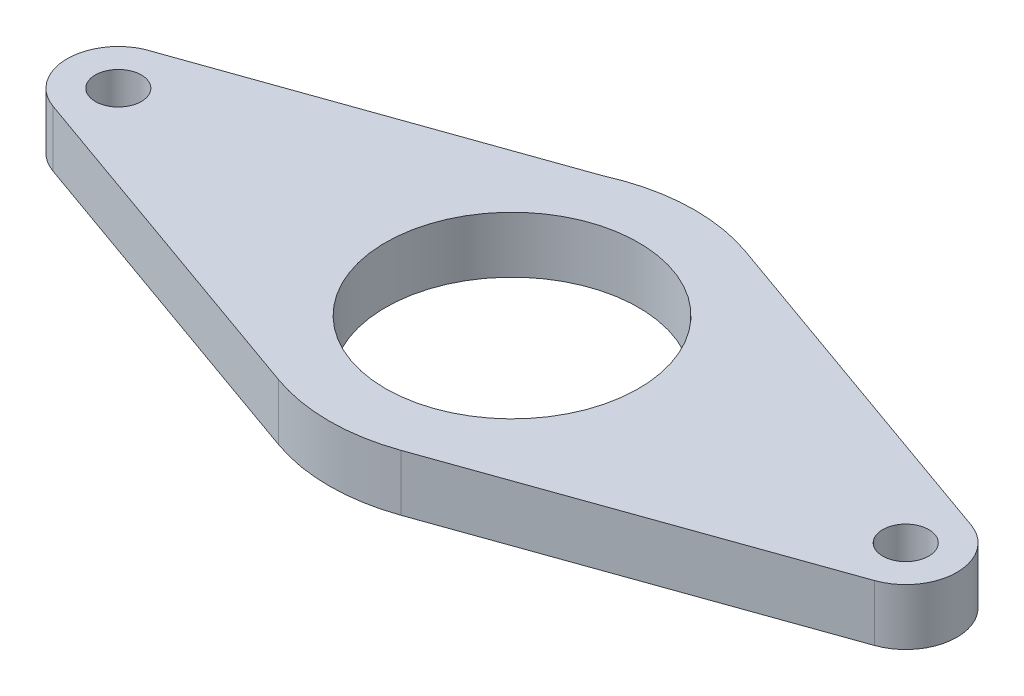
ISO-10303-21;
HEADER;
FILE_DESCRIPTION(('STEP AP214'),'2;1');
FILE_NAME('part.step','',(''),(''),'','','');
FILE_SCHEMA(('AUTOMOTIVE_DESIGN { 1 0 10303 214 1 1 1 1 }'));
ENDSEC;
DATA;
#1=APPLICATION_CONTEXT('core data for automotive mechanical design processes');
#2=APPLICATION_PROTOCOL_DEFINITION('international standard','automotive_design',2000,#1);
#3=PRODUCT_CONTEXT('',#1,'mechanical');
#4=PRODUCT('Part','Part','',(#3));
#5=PRODUCT_RELATED_PRODUCT_CATEGORY('part','',(#4));
#6=PRODUCT_DEFINITION_FORMATION('','',#4);
#7=PRODUCT_DEFINITION_CONTEXT('part definition',#1,'design');
#8=PRODUCT_DEFINITION('design','',#6,#7);
#9=PRODUCT_DEFINITION_SHAPE('','',#8);
#10=(LENGTH_UNIT() NAMED_UNIT(*) SI_UNIT(.MILLI.,.METRE.));
#11=(NAMED_UNIT(*) PLANE_ANGLE_UNIT() SI_UNIT($,.RADIAN.));
#12=(NAMED_UNIT(*) SI_UNIT($,.STERADIAN.) SOLID_ANGLE_UNIT());
#13=UNCERTAINTY_MEASURE_WITH_UNIT(LENGTH_MEASURE(1.E-05),#10,'distance_accuracy_value','');
#14=(GEOMETRIC_REPRESENTATION_CONTEXT(3) GLOBAL_UNCERTAINTY_ASSIGNED_CONTEXT((#13)) GLOBAL_UNIT_ASSIGNED_CONTEXT((#10,
#11,#12)) REPRESENTATION_CONTEXT('',''));
#15=CARTESIAN_POINT('',(0.,0.,0.));
#16=DIRECTION('',(0.,0.,1.));
#17=DIRECTION('',(1.,0.,0.));
#18=AXIS2_PLACEMENT_3D('',#15,#16,#17);
#19=CARTESIAN_POINT('',(6.90044642857143,6.35,19.4496849675365));
#20=DIRECTION('',(-0.334364454443195,0.,-0.942443850637747));
#21=DIRECTION('',(-0.942443850637747,0.,0.334364454443195));
#22=AXIS2_PLACEMENT_3D('',#19,#20,#21);
#23=PLANE('',#22);
#24=DIRECTION('',(0.942443850637747,0.,-0.334364454443195));
#25=VECTOR('',#24,1.);
#26=CARTESIAN_POINT('',(6.90044642857143,0.,19.4496849675365));
#27=LINE('',#26,#25);
#28=CARTESIAN_POINT('',(6.90044642857143,0.,19.4496849675365));
#29=VERTEX_POINT('',#28);
#30=CARTESIAN_POINT('',(46.3809547244094,0.,5.442613237433));
#31=VERTEX_POINT('',#30);
#32=EDGE_CURVE('E155',#29,#31,#27,.T.);
#33=ORIENTED_EDGE('',*,*,#32,.T.);
#34=DIRECTION('',(0.,-1.,0.));
#35=VECTOR('',#34,1.);
#36=CARTESIAN_POINT('',(46.3809547244094,6.35,5.442613237433));
#37=LINE('',#36,#35);
#38=CARTESIAN_POINT('',(46.3809547244094,6.35,5.442613237433));
#39=VERTEX_POINT('',#38);
#40=EDGE_CURVE('E11',#39,#31,#37,.T.);
#41=ORIENTED_EDGE('',*,*,#40,.F.);
#42=DIRECTION('',(0.942443850637747,0.,-0.334364454443195));
#43=VECTOR('',#42,1.);
#44=CARTESIAN_POINT('',(6.90044642857143,6.35,19.4496849675365));
#45=LINE('',#44,#43);
#46=CARTESIAN_POINT('',(6.90044642857143,6.35,19.4496849675365));
#47=VERTEX_POINT('',#46);
#48=EDGE_CURVE('E191',#47,#39,#45,.T.);
#49=ORIENTED_EDGE('',*,*,#48,.F.);
#50=DIRECTION('',(0.,-1.,0.));
#51=VECTOR('',#50,1.);
#52=CARTESIAN_POINT('',(6.90044642857143,6.35,19.4496849675365));
#53=LINE('',#52,#51);
#54=EDGE_CURVE('E154',#47,#29,#53,.T.);
#55=ORIENTED_EDGE('',*,*,#54,.T.);
#56=EDGE_LOOP('',(#33,#41,#49,#55));
#57=FACE_BOUND('',#56,.T.);
#58=ADVANCED_FACE('F41',(#57),#23,.F.);
#59=CARTESIAN_POINT('',(44.45,6.35,0.));
#60=DIRECTION('',(0.,-1.,0.));
#61=DIRECTION('',(0.,0.,-1.));
#62=AXIS2_PLACEMENT_3D('',#59,#60,#61);
#63=CYLINDRICAL_SURFACE('',#62,5.775);
#64=CARTESIAN_POINT('',(44.45,0.,0.));
#65=DIRECTION('',(0.,1.,0.));
#66=DIRECTION('',(0.,0.,1.));
#67=AXIS2_PLACEMENT_3D('',#64,#65,#66);
#68=CIRCLE('',#67,5.775);
#69=CARTESIAN_POINT('',(46.3809547244094,0.,-5.44261323743299));
#70=VERTEX_POINT('',#69);
#71=EDGE_CURVE('E159',#31,#70,#68,.T.);
#72=ORIENTED_EDGE('',*,*,#71,.T.);
#73=DIRECTION('',(0.,-1.,0.));
#74=VECTOR('',#73,1.);
#75=CARTESIAN_POINT('',(46.3809547244094,6.35,-5.44261323743299));
#76=LINE('',#75,#74);
#77=CARTESIAN_POINT('',(46.3809547244094,6.35,-5.44261323743299));
#78=VERTEX_POINT('',#77);
#79=EDGE_CURVE('E50',#78,#70,#76,.T.);
#80=ORIENTED_EDGE('',*,*,#79,.F.);
#81=CARTESIAN_POINT('',(44.45,6.35,0.));
#82=DIRECTION('',(0.,1.,0.));
#83=DIRECTION('',(0.,0.,1.));
#84=AXIS2_PLACEMENT_3D('',#81,#82,#83);
#85=CIRCLE('',#84,5.775);
#86=EDGE_CURVE('E101',#39,#78,#85,.T.);
#87=ORIENTED_EDGE('',*,*,#86,.F.);
#88=ORIENTED_EDGE('',*,*,#40,.T.);
#89=EDGE_LOOP('',(#72,#80,#87,#88));
#90=FACE_BOUND('',#89,.T.);
#91=ADVANCED_FACE('F211',(#90),#63,.T.);
#92=CARTESIAN_POINT('',(6.90044642857143,6.35,-19.4496849675365));
#93=DIRECTION('',(0.334364454443195,0.,-0.942443850637747));
#94=DIRECTION('',(-0.942443850637747,0.,-0.334364454443195));
#95=AXIS2_PLACEMENT_3D('',#92,#93,#94);
#96=PLANE('',#95);
#97=DIRECTION('',(0.942443850637748,0.,0.334364454443195));
#98=VECTOR('',#97,1.);
#99=CARTESIAN_POINT('',(6.90044642857143,0.,-19.4496849675365));
#100=LINE('',#99,#98);
#101=CARTESIAN_POINT('',(6.90044642857143,0.,-19.4496849675365));
#102=VERTEX_POINT('',#101);
#103=EDGE_CURVE('E163',#102,#70,#100,.T.);
#104=ORIENTED_EDGE('',*,*,#103,.F.);
#105=DIRECTION('',(0.,-1.,0.));
#106=VECTOR('',#105,1.);
#107=CARTESIAN_POINT('',(6.90044642857143,6.35,-19.4496849675365));
#108=LINE('',#107,#106);
#109=CARTESIAN_POINT('',(6.90044642857143,6.35,-19.4496849675365));
#110=VERTEX_POINT('',#109);
#111=EDGE_CURVE('E202',#110,#102,#108,.T.);
#112=ORIENTED_EDGE('',*,*,#111,.F.);
#113=DIRECTION('',(0.942443850637748,0.,0.334364454443195));
#114=VECTOR('',#113,1.);
#115=CARTESIAN_POINT('',(6.90044642857143,6.35,-19.4496849675365));
#116=LINE('',#115,#114);
#117=EDGE_CURVE('E210',#110,#78,#116,.T.);
#118=ORIENTED_EDGE('',*,*,#117,.T.);
#119=ORIENTED_EDGE('',*,*,#79,.T.);
#120=EDGE_LOOP('',(#104,#112,#118,#119));
#121=FACE_BOUND('',#120,.T.);
#122=ADVANCED_FACE('F208',(#121),#96,.T.);
#123=CARTESIAN_POINT('',(0.,6.35,0.));
#124=DIRECTION('',(0.,-1.,0.));
#125=DIRECTION('',(0.,0.,-1.));
#126=AXIS2_PLACEMENT_3D('',#123,#124,#125);
#127=CYLINDRICAL_SURFACE('',#126,20.6375);
#128=CARTESIAN_POINT('',(0.,0.,0.));
#129=DIRECTION('',(0.,1.,0.));
#130=DIRECTION('',(0.,0.,1.));
#131=AXIS2_PLACEMENT_3D('',#128,#129,#130);
#132=CIRCLE('',#131,20.6375);
#133=CARTESIAN_POINT('',(-8.44261363636364,0.,-18.8315873265396));
#134=VERTEX_POINT('',#133);
#135=EDGE_CURVE('E167',#102,#134,#132,.T.);
#136=ORIENTED_EDGE('',*,*,#135,.T.);
#137=DIRECTION('',(0.,-1.,0.));
#138=VECTOR('',#137,1.);
#139=CARTESIAN_POINT('',(-8.44261363636364,6.35,-18.8315873265396));
#140=LINE('',#139,#138);
#141=CARTESIAN_POINT('',(-8.44261363636364,6.35,-18.8315873265396));
#142=VERTEX_POINT('',#141);
#143=EDGE_CURVE('E198',#142,#134,#140,.T.);
#144=ORIENTED_EDGE('',*,*,#143,.F.);
#145=CARTESIAN_POINT('',(0.,6.35,0.));
#146=DIRECTION('',(0.,1.,0.));
#147=DIRECTION('',(0.,0.,1.));
#148=AXIS2_PLACEMENT_3D('',#145,#146,#147);
#149=CIRCLE('',#148,20.6375);
#150=EDGE_CURVE('E226',#110,#142,#149,.T.);
#151=ORIENTED_EDGE('',*,*,#150,.F.);
#152=ORIENTED_EDGE('',*,*,#111,.T.);
#153=EDGE_LOOP('',(#136,#144,#151,#152));
#154=FACE_BOUND('',#153,.T.);
#155=ADVANCED_FACE('F221',(#154),#127,.T.);
#156=CARTESIAN_POINT('',(-6.85447760040929,6.35,-19.3929181585401));
#157=DIRECTION('',(0.333248872563735,0.,0.942838898717591));
#158=DIRECTION('',(0.942838898717591,0.,-0.333248872563735));
#159=AXIS2_PLACEMENT_3D('',#156,#157,#158);
#160=PLANE('',#159);
#161=DIRECTION('',(-0.942838898717591,0.,0.333248872563735));
#162=VECTOR('',#161,1.);
#163=CARTESIAN_POINT('',(-6.85447760040929,0.,-19.3929181585401));
#164=LINE('',#163,#162);
#165=CARTESIAN_POINT('',(-46.8125,0.,-5.26965072371973));
#166=VERTEX_POINT('',#165);
#167=EDGE_CURVE('E170',#134,#166,#164,.T.);
#168=ORIENTED_EDGE('',*,*,#167,.T.);
#169=DIRECTION('',(0.,-1.,0.));
#170=VECTOR('',#169,1.);
#171=CARTESIAN_POINT('',(-46.8125,6.35,-5.26965072371973));
#172=LINE('',#171,#170);
#173=CARTESIAN_POINT('',(-46.8125,6.35,-5.26965072371973));
#174=VERTEX_POINT('',#173);
#175=EDGE_CURVE('E132',#174,#166,#172,.T.);
#176=ORIENTED_EDGE('',*,*,#175,.F.);
#177=DIRECTION('',(-0.942838898717591,0.,0.333248872563735));
#178=VECTOR('',#177,1.);
#179=CARTESIAN_POINT('',(-6.85447760040929,6.35,-19.3929181585401));
#180=LINE('',#179,#178);
#181=EDGE_CURVE('E121',#142,#174,#180,.T.);
#182=ORIENTED_EDGE('',*,*,#181,.F.);
#183=ORIENTED_EDGE('',*,*,#143,.T.);
#184=EDGE_LOOP('',(#168,#176,#182,#183));
#185=FACE_BOUND('',#184,.T.);
#186=ADVANCED_FACE('F224',(#185),#160,.F.);
#187=CARTESIAN_POINT('',(-44.45,6.35,0.));
#188=DIRECTION('',(0.,-1.,0.));
#189=DIRECTION('',(0.,0.,-1.));
#190=AXIS2_PLACEMENT_3D('',#187,#188,#189);
#191=CYLINDRICAL_SURFACE('',#190,5.775);
#192=CARTESIAN_POINT('',(-44.45,0.,0.));
#193=DIRECTION('',(0.,1.,0.));
#194=DIRECTION('',(0.,0.,1.));
#195=AXIS2_PLACEMENT_3D('',#192,#193,#194);
#196=CIRCLE('',#195,5.775);
#197=CARTESIAN_POINT('',(-46.3809547244094,0.,5.442613237433));
#198=VERTEX_POINT('',#197);
#199=EDGE_CURVE('E130',#166,#198,#196,.T.);
#200=ORIENTED_EDGE('',*,*,#199,.T.);
#201=DIRECTION('',(0.,-1.,0.));
#202=VECTOR('',#201,1.);
#203=CARTESIAN_POINT('',(-46.3809547244094,6.35,5.442613237433));
#204=LINE('',#203,#202);
#205=CARTESIAN_POINT('',(-46.3809547244094,6.35,5.442613237433));
#206=VERTEX_POINT('',#205);
#207=EDGE_CURVE('E127',#206,#198,#204,.T.);
#208=ORIENTED_EDGE('',*,*,#207,.F.);
#209=CARTESIAN_POINT('',(-44.45,6.35,0.));
#210=DIRECTION('',(0.,1.,0.));
#211=DIRECTION('',(0.,0.,1.));
#212=AXIS2_PLACEMENT_3D('',#209,#210,#211);
#213=CIRCLE('',#212,5.775);
#214=EDGE_CURVE('E114',#174,#206,#213,.T.);
#215=ORIENTED_EDGE('',*,*,#214,.F.);
#216=ORIENTED_EDGE('',*,*,#175,.T.);
#217=EDGE_LOOP('',(#200,#208,#215,#216));
#218=FACE_BOUND('',#217,.T.);
#219=ADVANCED_FACE('F128',(#218),#191,.T.);
#220=CARTESIAN_POINT('',(-6.90044642857142,6.35,19.4496849675365));
#221=DIRECTION('',(0.334364454443194,0.,-0.942443850637747));
#222=DIRECTION('',(-0.942443850637747,0.,-0.334364454443194));
#223=AXIS2_PLACEMENT_3D('',#220,#221,#222);
#224=PLANE('',#223);
#225=DIRECTION('',(0.942443850637747,0.,0.334364454443194));
#226=VECTOR('',#225,1.);
#227=CARTESIAN_POINT('',(-6.90044642857142,0.,19.4496849675365));
#228=LINE('',#227,#226);
#229=CARTESIAN_POINT('',(-6.90044642857143,0.,19.4496849675365));
#230=VERTEX_POINT('',#229);
#231=EDGE_CURVE('E87',#198,#230,#228,.T.);
#232=ORIENTED_EDGE('',*,*,#231,.T.);
#233=DIRECTION('',(0.,-1.,0.));
#234=VECTOR('',#233,1.);
#235=CARTESIAN_POINT('',(-6.90044642857143,6.35,19.4496849675365));
#236=LINE('',#235,#234);
#237=CARTESIAN_POINT('',(-6.90044642857143,6.35,19.4496849675365));
#238=VERTEX_POINT('',#237);
#239=EDGE_CURVE('E133',#238,#230,#236,.T.);
#240=ORIENTED_EDGE('',*,*,#239,.F.);
#241=DIRECTION('',(0.942443850637747,0.,0.334364454443194));
#242=VECTOR('',#241,1.);
#243=CARTESIAN_POINT('',(-6.90044642857142,6.35,19.4496849675365));
#244=LINE('',#243,#242);
#245=EDGE_CURVE('E119',#206,#238,#244,.T.);
#246=ORIENTED_EDGE('',*,*,#245,.F.);
#247=ORIENTED_EDGE('',*,*,#207,.T.);
#248=EDGE_LOOP('',(#232,#240,#246,#247));
#249=FACE_BOUND('',#248,.T.);
#250=ADVANCED_FACE('F135',(#249),#224,.F.);
#251=CARTESIAN_POINT('',(-44.45,6.35,0.));
#252=DIRECTION('',(0.,-1.,0.));
#253=DIRECTION('',(0.,0.,-1.));
#254=AXIS2_PLACEMENT_3D('',#251,#252,#253);
#255=CYLINDRICAL_SURFACE('',#254,2.6);
#256=CARTESIAN_POINT('',(-44.45,6.35,0.));
#257=DIRECTION('',(0.,1.,0.));
#258=DIRECTION('',(0.,0.,1.));
#259=AXIS2_PLACEMENT_3D('',#256,#257,#258);
#260=CIRCLE('',#259,2.6);
#261=CARTESIAN_POINT('',(-44.45,6.35,2.6));
#262=VERTEX_POINT('',#261);
#263=EDGE_CURVE('E146',#262,#262,#260,.T.);
#264=ORIENTED_EDGE('',*,*,#263,.T.);
#265=EDGE_LOOP('',(#264));
#266=FACE_BOUND('',#265,.T.);
#267=CARTESIAN_POINT('',(-44.45,0.,0.));
#268=DIRECTION('',(0.,1.,0.));
#269=DIRECTION('',(0.,0.,1.));
#270=AXIS2_PLACEMENT_3D('',#267,#268,#269);
#271=CIRCLE('',#270,2.6);
#272=CARTESIAN_POINT('',(-44.45,0.,2.6));
#273=VERTEX_POINT('',#272);
#274=EDGE_CURVE('E183',#273,#273,#271,.T.);
#275=ORIENTED_EDGE('',*,*,#274,.F.);
#276=EDGE_LOOP('',(#275));
#277=FACE_BOUND('',#276,.T.);
#278=ADVANCED_FACE('F248',(#266,#277),#255,.F.);
#279=CARTESIAN_POINT('',(0.,6.35,0.));
#280=DIRECTION('',(0.,-1.,0.));
#281=DIRECTION('',(0.,0.,-1.));
#282=AXIS2_PLACEMENT_3D('',#279,#280,#281);
#283=CYLINDRICAL_SURFACE('',#282,14.2875);
#284=CARTESIAN_POINT('',(0.,6.35,0.));
#285=DIRECTION('',(0.,1.,0.));
#286=DIRECTION('',(0.,0.,1.));
#287=AXIS2_PLACEMENT_3D('',#284,#285,#286);
#288=CIRCLE('',#287,14.2875);
#289=CARTESIAN_POINT('',(0.,6.35,14.2875));
#290=VERTEX_POINT('',#289);
#291=EDGE_CURVE('E139',#290,#290,#288,.T.);
#292=ORIENTED_EDGE('',*,*,#291,.T.);
#293=EDGE_LOOP('',(#292));
#294=FACE_BOUND('',#293,.T.);
#295=CARTESIAN_POINT('',(0.,0.,0.));
#296=DIRECTION('',(0.,1.,0.));
#297=DIRECTION('',(0.,0.,1.));
#298=AXIS2_PLACEMENT_3D('',#295,#296,#297);
#299=CIRCLE('',#298,14.2875);
#300=CARTESIAN_POINT('',(0.,0.,14.2875));
#301=VERTEX_POINT('',#300);
#302=EDGE_CURVE('E179',#301,#301,#299,.T.);
#303=ORIENTED_EDGE('',*,*,#302,.F.);
#304=EDGE_LOOP('',(#303));
#305=FACE_BOUND('',#304,.T.);
#306=ADVANCED_FACE('F240',(#294,#305),#283,.F.);
#307=CARTESIAN_POINT('',(0.,6.35,0.));
#308=DIRECTION('',(0.,-1.,0.));
#309=DIRECTION('',(0.,0.,-1.));
#310=AXIS2_PLACEMENT_3D('',#307,#308,#309);
#311=CYLINDRICAL_SURFACE('',#310,20.6375);
#312=CARTESIAN_POINT('',(0.,0.,0.));
#313=DIRECTION('',(0.,1.,0.));
#314=DIRECTION('',(0.,0.,1.));
#315=AXIS2_PLACEMENT_3D('',#312,#313,#314);
#316=CIRCLE('',#315,20.6375);
#317=EDGE_CURVE('E93',#230,#29,#316,.T.);
#318=ORIENTED_EDGE('',*,*,#317,.T.);
#319=ORIENTED_EDGE('',*,*,#54,.F.);
#320=CARTESIAN_POINT('',(0.,6.35,0.));
#321=DIRECTION('',(0.,1.,0.));
#322=DIRECTION('',(0.,0.,1.));
#323=AXIS2_PLACEMENT_3D('',#320,#321,#322);
#324=CIRCLE('',#323,20.6375);
#325=EDGE_CURVE('E58',#238,#47,#324,.T.);
#326=ORIENTED_EDGE('',*,*,#325,.F.);
#327=ORIENTED_EDGE('',*,*,#239,.T.);
#328=EDGE_LOOP('',(#318,#319,#326,#327));
#329=FACE_BOUND('',#328,.T.);
#330=ADVANCED_FACE('F237',(#329),#311,.T.);
#331=CARTESIAN_POINT('',(44.45,6.35,0.));
#332=DIRECTION('',(0.,-1.,0.));
#333=DIRECTION('',(0.,0.,-1.));
#334=AXIS2_PLACEMENT_3D('',#331,#332,#333);
#335=CYLINDRICAL_SURFACE('',#334,2.6);
#336=CARTESIAN_POINT('',(44.45,6.35,0.));
#337=DIRECTION('',(0.,1.,0.));
#338=DIRECTION('',(0.,0.,1.));
#339=AXIS2_PLACEMENT_3D('',#336,#337,#338);
#340=CIRCLE('',#339,2.6);
#341=CARTESIAN_POINT('',(44.45,6.35,2.6));
#342=VERTEX_POINT('',#341);
#343=EDGE_CURVE('E150',#342,#342,#340,.T.);
#344=ORIENTED_EDGE('',*,*,#343,.T.);
#345=EDGE_LOOP('',(#344));
#346=FACE_BOUND('',#345,.T.);
#347=CARTESIAN_POINT('',(44.45,0.,0.));
#348=DIRECTION('',(0.,1.,0.));
#349=DIRECTION('',(0.,0.,1.));
#350=AXIS2_PLACEMENT_3D('',#347,#348,#349);
#351=CIRCLE('',#350,2.6);
#352=CARTESIAN_POINT('',(44.45,0.,2.6));
#353=VERTEX_POINT('',#352);
#354=EDGE_CURVE('E187',#353,#353,#351,.T.);
#355=ORIENTED_EDGE('',*,*,#354,.F.);
#356=EDGE_LOOP('',(#355));
#357=FACE_BOUND('',#356,.T.);
#358=ADVANCED_FACE('F239',(#346,#357),#335,.F.);
#359=CARTESIAN_POINT('',(0.,6.35,0.));
#360=DIRECTION('',(0.,1.,0.));
#361=DIRECTION('',(0.,0.,1.));
#362=AXIS2_PLACEMENT_3D('',#359,#360,#361);
#363=PLANE('',#362);
#364=ORIENTED_EDGE('',*,*,#48,.T.);
#365=ORIENTED_EDGE('',*,*,#86,.T.);
#366=ORIENTED_EDGE('',*,*,#117,.F.);
#367=ORIENTED_EDGE('',*,*,#150,.T.);
#368=ORIENTED_EDGE('',*,*,#181,.T.);
#369=ORIENTED_EDGE('',*,*,#214,.T.);
#370=ORIENTED_EDGE('',*,*,#245,.T.);
#371=ORIENTED_EDGE('',*,*,#325,.T.);
#372=EDGE_LOOP('',(#364,#365,#366,#367,#368,#369,#370,#371));
#373=FACE_BOUND('',#372,.T.);
#374=ORIENTED_EDGE('',*,*,#291,.F.);
#375=EDGE_LOOP('',(#374));
#376=FACE_BOUND('',#375,.T.);
#377=ORIENTED_EDGE('',*,*,#263,.F.);
#378=EDGE_LOOP('',(#377));
#379=FACE_BOUND('',#378,.T.);
#380=ORIENTED_EDGE('',*,*,#343,.F.);
#381=EDGE_LOOP('',(#380));
#382=FACE_BOUND('',#381,.T.);
#383=ADVANCED_FACE('F116',(#373,#376,#379,#382),#363,.T.);
#384=CARTESIAN_POINT('',(0.,0.,0.));
#385=DIRECTION('',(0.,1.,0.));
#386=DIRECTION('',(0.,0.,1.));
#387=AXIS2_PLACEMENT_3D('',#384,#385,#386);
#388=PLANE('',#387);
#389=ORIENTED_EDGE('',*,*,#32,.F.);
#390=ORIENTED_EDGE('',*,*,#317,.F.);
#391=ORIENTED_EDGE('',*,*,#231,.F.);
#392=ORIENTED_EDGE('',*,*,#199,.F.);
#393=ORIENTED_EDGE('',*,*,#167,.F.);
#394=ORIENTED_EDGE('',*,*,#135,.F.);
#395=ORIENTED_EDGE('',*,*,#103,.T.);
#396=ORIENTED_EDGE('',*,*,#71,.F.);
#397=EDGE_LOOP('',(#389,#390,#391,#392,#393,#394,#395,#396));
#398=FACE_BOUND('',#397,.T.);
#399=ORIENTED_EDGE('',*,*,#302,.T.);
#400=EDGE_LOOP('',(#399));
#401=FACE_BOUND('',#400,.T.);
#402=ORIENTED_EDGE('',*,*,#274,.T.);
#403=EDGE_LOOP('',(#402));
#404=FACE_BOUND('',#403,.T.);
#405=ORIENTED_EDGE('',*,*,#354,.T.);
#406=EDGE_LOOP('',(#405));
#407=FACE_BOUND('',#406,.T.);
#408=ADVANCED_FACE('F216',(#398,#401,#404,#407),#388,.F.);
#409=CLOSED_SHELL('',(#58,#91,#122,#155,#186,#219,#250,#278,#306,#330,#358,#383,#408));
#410=MANIFOLD_SOLID_BREP('B2',#409);
#411=ADVANCED_BREP_SHAPE_REPRESENTATION('',(#18,#410),#14);
#412=SHAPE_DEFINITION_REPRESENTATION(#9,#411);
ENDSEC;
END-ISO-10303-21;
